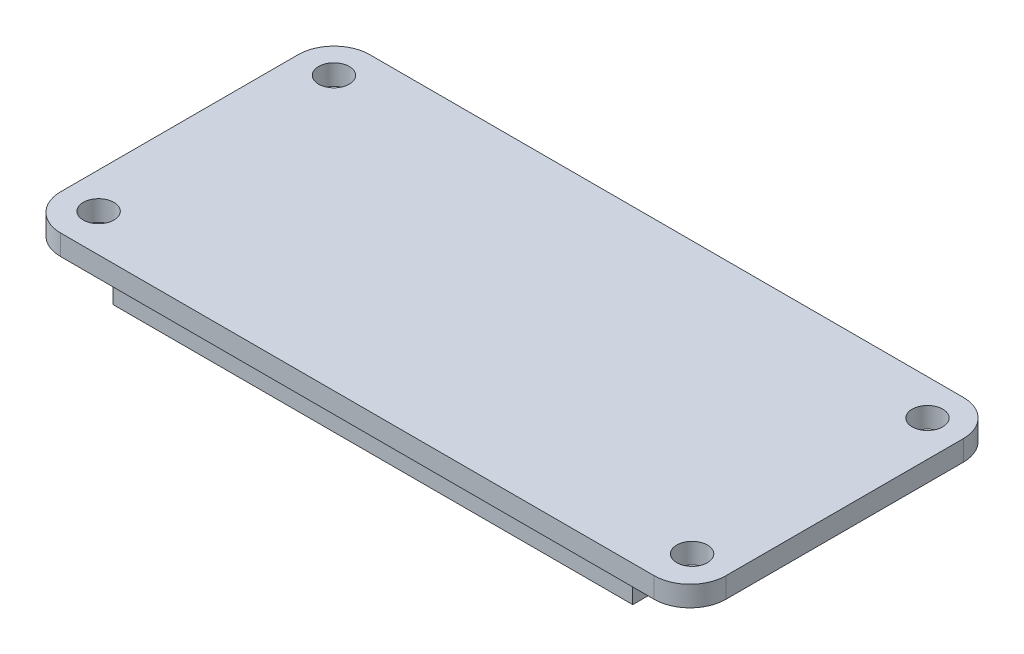
ISO-10303-21;
HEADER;
FILE_DESCRIPTION(('STEP AP214'),'2;1');
FILE_NAME('part.step','',(''),(''),'','','');
FILE_SCHEMA(('AUTOMOTIVE_DESIGN { 1 0 10303 214 1 1 1 1 }'));
ENDSEC;
DATA;
#1=APPLICATION_CONTEXT('core data for automotive mechanical design processes');
#2=APPLICATION_PROTOCOL_DEFINITION('international standard','automotive_design',2000,#1);
#3=PRODUCT_CONTEXT('',#1,'mechanical');
#4=PRODUCT('Part','Part','',(#3));
#5=PRODUCT_RELATED_PRODUCT_CATEGORY('part','',(#4));
#6=PRODUCT_DEFINITION_FORMATION('','',#4);
#7=PRODUCT_DEFINITION_CONTEXT('part definition',#1,'design');
#8=PRODUCT_DEFINITION('design','',#6,#7);
#9=PRODUCT_DEFINITION_SHAPE('','',#8);
#10=(LENGTH_UNIT() NAMED_UNIT(*) SI_UNIT(.MILLI.,.METRE.));
#11=(NAMED_UNIT(*) PLANE_ANGLE_UNIT() SI_UNIT($,.RADIAN.));
#12=(NAMED_UNIT(*) SI_UNIT($,.STERADIAN.) SOLID_ANGLE_UNIT());
#13=UNCERTAINTY_MEASURE_WITH_UNIT(LENGTH_MEASURE(1.E-05),#10,'distance_accuracy_value','');
#14=(GEOMETRIC_REPRESENTATION_CONTEXT(3) GLOBAL_UNCERTAINTY_ASSIGNED_CONTEXT((#13)) GLOBAL_UNIT_ASSIGNED_CONTEXT((#10,
#11,#12)) REPRESENTATION_CONTEXT('',''));
#15=CARTESIAN_POINT('',(0.,0.,0.));
#16=DIRECTION('',(0.,0.,1.));
#17=DIRECTION('',(1.,0.,0.));
#18=AXIS2_PLACEMENT_3D('',#15,#16,#17);
#19=CARTESIAN_POINT('',(0.,0.,0.));
#20=DIRECTION('',(0.,1.,0.));
#21=DIRECTION('',(0.,0.,1.));
#22=AXIS2_PLACEMENT_3D('',#19,#20,#21);
#23=PLANE('',#22);
#24=DIRECTION('',(0.,0.,1.));
#25=VECTOR('',#24,1.);
#26=CARTESIAN_POINT('',(-32.5,0.,-15.1));
#27=LINE('',#26,#25);
#28=CARTESIAN_POINT('',(-32.5,0.,-11.6));
#29=VERTEX_POINT('',#28);
#30=CARTESIAN_POINT('',(-32.5,0.,11.6));
#31=VERTEX_POINT('',#30);
#32=EDGE_CURVE('E192',#29,#31,#27,.T.);
#33=ORIENTED_EDGE('',*,*,#32,.F.);
#34=CARTESIAN_POINT('',(-29.,0.,-11.6));
#35=DIRECTION('',(0.,1.,0.));
#36=DIRECTION('',(0.,0.,1.));
#37=AXIS2_PLACEMENT_3D('',#34,#35,#36);
#38=CIRCLE('',#37,3.5);
#39=CARTESIAN_POINT('',(-29.,0.,-15.1));
#40=VERTEX_POINT('',#39);
#41=EDGE_CURVE('E207',#29,#40,#38,.F.);
#42=ORIENTED_EDGE('',*,*,#41,.T.);
#43=DIRECTION('',(-1.,0.,0.));
#44=VECTOR('',#43,1.);
#45=CARTESIAN_POINT('',(-32.5,0.,-15.1));
#46=LINE('',#45,#44);
#47=CARTESIAN_POINT('',(29.,0.,-15.1));
#48=VERTEX_POINT('',#47);
#49=EDGE_CURVE('E189',#48,#40,#46,.T.);
#50=ORIENTED_EDGE('',*,*,#49,.F.);
#51=CARTESIAN_POINT('',(29.,0.,-11.6));
#52=DIRECTION('',(0.,1.,0.));
#53=DIRECTION('',(0.,0.,1.));
#54=AXIS2_PLACEMENT_3D('',#51,#52,#53);
#55=CIRCLE('',#54,3.5);
#56=CARTESIAN_POINT('',(32.5,0.,-11.6));
#57=VERTEX_POINT('',#56);
#58=EDGE_CURVE('E201',#48,#57,#55,.F.);
#59=ORIENTED_EDGE('',*,*,#58,.T.);
#60=DIRECTION('',(0.,0.,-1.));
#61=VECTOR('',#60,1.);
#62=CARTESIAN_POINT('',(32.5,0.,-15.1));
#63=LINE('',#62,#61);
#64=CARTESIAN_POINT('',(32.5,0.,11.6));
#65=VERTEX_POINT('',#64);
#66=EDGE_CURVE('E170',#65,#57,#63,.T.);
#67=ORIENTED_EDGE('',*,*,#66,.F.);
#68=CARTESIAN_POINT('',(29.,0.,11.6));
#69=DIRECTION('',(0.,1.,0.));
#70=DIRECTION('',(0.,0.,1.));
#71=AXIS2_PLACEMENT_3D('',#68,#69,#70);
#72=CIRCLE('',#71,3.5);
#73=CARTESIAN_POINT('',(29.,0.,15.1));
#74=VERTEX_POINT('',#73);
#75=EDGE_CURVE('E203',#65,#74,#72,.F.);
#76=ORIENTED_EDGE('',*,*,#75,.T.);
#77=DIRECTION('',(1.,0.,0.));
#78=VECTOR('',#77,1.);
#79=CARTESIAN_POINT('',(-32.5,0.,15.1));
#80=LINE('',#79,#78);
#81=CARTESIAN_POINT('',(-29.,0.,15.1));
#82=VERTEX_POINT('',#81);
#83=EDGE_CURVE('E177',#82,#74,#80,.T.);
#84=ORIENTED_EDGE('',*,*,#83,.F.);
#85=CARTESIAN_POINT('',(-29.,0.,11.6));
#86=DIRECTION('',(0.,1.,0.));
#87=DIRECTION('',(0.,0.,1.));
#88=AXIS2_PLACEMENT_3D('',#85,#86,#87);
#89=CIRCLE('',#88,3.5);
#90=EDGE_CURVE('E205',#82,#31,#89,.F.);
#91=ORIENTED_EDGE('',*,*,#90,.T.);
#92=EDGE_LOOP('',(#33,#42,#50,#59,#67,#76,#84,#91));
#93=FACE_BOUND('',#92,.T.);
#94=CARTESIAN_POINT('',(-29.,0.,-11.6));
#95=DIRECTION('',(0.,1.,0.));
#96=DIRECTION('',(0.,0.,1.));
#97=AXIS2_PLACEMENT_3D('',#94,#95,#96);
#98=CIRCLE('',#97,1.5);
#99=CARTESIAN_POINT('',(-29.,0.,-10.1));
#100=VERTEX_POINT('',#99);
#101=EDGE_CURVE('E167',#100,#100,#98,.T.);
#102=ORIENTED_EDGE('',*,*,#101,.T.);
#103=EDGE_LOOP('',(#102));
#104=FACE_BOUND('',#103,.T.);
#105=CARTESIAN_POINT('',(-29.,0.,11.4));
#106=DIRECTION('',(0.,1.,0.));
#107=DIRECTION('',(0.,0.,1.));
#108=AXIS2_PLACEMENT_3D('',#105,#106,#107);
#109=CIRCLE('',#108,1.5);
#110=CARTESIAN_POINT('',(-29.,0.,12.9));
#111=VERTEX_POINT('',#110);
#112=EDGE_CURVE('E152',#111,#111,#109,.T.);
#113=ORIENTED_EDGE('',*,*,#112,.T.);
#114=EDGE_LOOP('',(#113));
#115=FACE_BOUND('',#114,.T.);
#116=CARTESIAN_POINT('',(29.,0.,11.4));
#117=DIRECTION('',(0.,1.,0.));
#118=DIRECTION('',(0.,0.,-1.));
#119=AXIS2_PLACEMENT_3D('',#116,#117,#118);
#120=CIRCLE('',#119,1.5);
#121=CARTESIAN_POINT('',(29.,0.,9.89999999999998));
#122=VERTEX_POINT('',#121);
#123=EDGE_CURVE('E159',#122,#122,#120,.T.);
#124=ORIENTED_EDGE('',*,*,#123,.T.);
#125=EDGE_LOOP('',(#124));
#126=FACE_BOUND('',#125,.T.);
#127=CARTESIAN_POINT('',(29.,0.,-11.6));
#128=DIRECTION('',(0.,1.,0.));
#129=DIRECTION('',(0.,0.,-1.));
#130=AXIS2_PLACEMENT_3D('',#127,#128,#129);
#131=CIRCLE('',#130,1.5);
#132=CARTESIAN_POINT('',(29.,0.,-13.1));
#133=VERTEX_POINT('',#132);
#134=EDGE_CURVE('E146',#133,#133,#131,.T.);
#135=ORIENTED_EDGE('',*,*,#134,.T.);
#136=EDGE_LOOP('',(#135));
#137=FACE_BOUND('',#136,.T.);
#138=DIRECTION('',(0.,0.,1.));
#139=VECTOR('',#138,1.);
#140=CARTESIAN_POINT('',(25.4,0.,13.6));
#141=LINE('',#140,#139);
#142=CARTESIAN_POINT('',(25.4,0.,8.52));
#143=VERTEX_POINT('',#142);
#144=CARTESIAN_POINT('',(25.4,0.,13.6));
#145=VERTEX_POINT('',#144);
#146=EDGE_CURVE('E142',#143,#145,#141,.T.);
#147=ORIENTED_EDGE('',*,*,#146,.F.);
#148=DIRECTION('',(1.,0.,0.));
#149=VECTOR('',#148,1.);
#150=CARTESIAN_POINT('',(-25.4,0.,8.52));
#151=LINE('',#150,#149);
#152=CARTESIAN_POINT('',(-25.4,0.,8.52));
#153=VERTEX_POINT('',#152);
#154=EDGE_CURVE('E139',#153,#143,#151,.T.);
#155=ORIENTED_EDGE('',*,*,#154,.F.);
#156=DIRECTION('',(0.,0.,-1.));
#157=VECTOR('',#156,1.);
#158=CARTESIAN_POINT('',(-25.4,0.,13.6));
#159=LINE('',#158,#157);
#160=CARTESIAN_POINT('',(-25.4,0.,13.6));
#161=VERTEX_POINT('',#160);
#162=EDGE_CURVE('E53',#161,#153,#159,.T.);
#163=ORIENTED_EDGE('',*,*,#162,.F.);
#164=DIRECTION('',(-1.,0.,0.));
#165=VECTOR('',#164,1.);
#166=CARTESIAN_POINT('',(-25.4,0.,13.6));
#167=LINE('',#166,#165);
#168=EDGE_CURVE('E48',#145,#161,#167,.T.);
#169=ORIENTED_EDGE('',*,*,#168,.F.);
#170=EDGE_LOOP('',(#147,#155,#163,#169));
#171=FACE_BOUND('',#170,.T.);
#172=ADVANCED_FACE('F33',(#93,#104,#115,#126,#137,#171),#23,.F.);
#173=CARTESIAN_POINT('',(32.5,2.,-15.1));
#174=DIRECTION('',(-1.,0.,0.));
#175=DIRECTION('',(0.,0.,1.));
#176=AXIS2_PLACEMENT_3D('',#173,#174,#175);
#177=PLANE('',#176);
#178=DIRECTION('',(0.,0.,-1.));
#179=VECTOR('',#178,1.);
#180=CARTESIAN_POINT('',(32.5,2.,-15.1));
#181=LINE('',#180,#179);
#182=CARTESIAN_POINT('',(32.5,2.,11.6));
#183=VERTEX_POINT('',#182);
#184=CARTESIAN_POINT('',(32.5,2.,-11.6));
#185=VERTEX_POINT('',#184);
#186=EDGE_CURVE('E173',#183,#185,#181,.T.);
#187=ORIENTED_EDGE('',*,*,#186,.F.);
#188=DIRECTION('',(0.,-1.,0.));
#189=VECTOR('',#188,1.);
#190=CARTESIAN_POINT('',(32.5,2.,11.6));
#191=LINE('',#190,#189);
#192=EDGE_CURVE('E11',#183,#65,#191,.T.);
#193=ORIENTED_EDGE('',*,*,#192,.T.);
#194=ORIENTED_EDGE('',*,*,#66,.T.);
#195=DIRECTION('',(0.,-1.,0.));
#196=VECTOR('',#195,1.);
#197=CARTESIAN_POINT('',(32.5,2.,-11.6));
#198=LINE('',#197,#196);
#199=EDGE_CURVE('E41',#57,#185,#198,.F.);
#200=ORIENTED_EDGE('',*,*,#199,.T.);
#201=EDGE_LOOP('',(#187,#193,#194,#200));
#202=FACE_BOUND('',#201,.T.);
#203=ADVANCED_FACE('F229',(#202),#177,.F.);
#204=CARTESIAN_POINT('',(-32.5,2.,-15.1));
#205=DIRECTION('',(0.,0.,1.));
#206=DIRECTION('',(1.,0.,0.));
#207=AXIS2_PLACEMENT_3D('',#204,#205,#206);
#208=PLANE('',#207);
#209=ORIENTED_EDGE('',*,*,#49,.T.);
#210=DIRECTION('',(0.,-1.,0.));
#211=VECTOR('',#210,1.);
#212=CARTESIAN_POINT('',(-29.,2.,-15.1));
#213=LINE('',#212,#211);
#214=CARTESIAN_POINT('',(-29.,2.,-15.1));
#215=VERTEX_POINT('',#214);
#216=EDGE_CURVE('E212',#40,#215,#213,.F.);
#217=ORIENTED_EDGE('',*,*,#216,.T.);
#218=DIRECTION('',(-1.,0.,0.));
#219=VECTOR('',#218,1.);
#220=CARTESIAN_POINT('',(-32.5,2.,-15.1));
#221=LINE('',#220,#219);
#222=CARTESIAN_POINT('',(29.,2.,-15.1));
#223=VERTEX_POINT('',#222);
#224=EDGE_CURVE('E176',#223,#215,#221,.T.);
#225=ORIENTED_EDGE('',*,*,#224,.F.);
#226=DIRECTION('',(0.,-1.,0.));
#227=VECTOR('',#226,1.);
#228=CARTESIAN_POINT('',(29.,2.,-15.1));
#229=LINE('',#228,#227);
#230=EDGE_CURVE('E209',#223,#48,#229,.T.);
#231=ORIENTED_EDGE('',*,*,#230,.T.);
#232=EDGE_LOOP('',(#209,#217,#225,#231));
#233=FACE_BOUND('',#232,.T.);
#234=ADVANCED_FACE('F241',(#233),#208,.F.);
#235=CARTESIAN_POINT('',(-32.5,2.,-15.1));
#236=DIRECTION('',(1.,0.,0.));
#237=DIRECTION('',(0.,0.,-1.));
#238=AXIS2_PLACEMENT_3D('',#235,#236,#237);
#239=PLANE('',#238);
#240=DIRECTION('',(0.,0.,1.));
#241=VECTOR('',#240,1.);
#242=CARTESIAN_POINT('',(-32.5,2.,-15.1));
#243=LINE('',#242,#241);
#244=CARTESIAN_POINT('',(-32.5,2.,-11.6));
#245=VERTEX_POINT('',#244);
#246=CARTESIAN_POINT('',(-32.5,2.,11.6));
#247=VERTEX_POINT('',#246);
#248=EDGE_CURVE('E180',#245,#247,#243,.T.);
#249=ORIENTED_EDGE('',*,*,#248,.F.);
#250=DIRECTION('',(0.,-1.,0.));
#251=VECTOR('',#250,1.);
#252=CARTESIAN_POINT('',(-32.5,2.,-11.6));
#253=LINE('',#252,#251);
#254=EDGE_CURVE('E198',#245,#29,#253,.T.);
#255=ORIENTED_EDGE('',*,*,#254,.T.);
#256=ORIENTED_EDGE('',*,*,#32,.T.);
#257=DIRECTION('',(0.,-1.,0.));
#258=VECTOR('',#257,1.);
#259=CARTESIAN_POINT('',(-32.5,2.,11.6));
#260=LINE('',#259,#258);
#261=EDGE_CURVE('E186',#31,#247,#260,.F.);
#262=ORIENTED_EDGE('',*,*,#261,.T.);
#263=EDGE_LOOP('',(#249,#255,#256,#262));
#264=FACE_BOUND('',#263,.T.);
#265=ADVANCED_FACE('F252',(#264),#239,.F.);
#266=CARTESIAN_POINT('',(-32.5,2.,15.1));
#267=DIRECTION('',(0.,0.,-1.));
#268=DIRECTION('',(-1.,0.,0.));
#269=AXIS2_PLACEMENT_3D('',#266,#267,#268);
#270=PLANE('',#269);
#271=DIRECTION('',(1.,0.,0.));
#272=VECTOR('',#271,1.);
#273=CARTESIAN_POINT('',(-32.5,2.,15.1));
#274=LINE('',#273,#272);
#275=CARTESIAN_POINT('',(-29.,2.,15.1));
#276=VERTEX_POINT('',#275);
#277=CARTESIAN_POINT('',(29.,2.,15.1));
#278=VERTEX_POINT('',#277);
#279=EDGE_CURVE('E183',#276,#278,#274,.T.);
#280=ORIENTED_EDGE('',*,*,#279,.F.);
#281=DIRECTION('',(0.,-1.,0.));
#282=VECTOR('',#281,1.);
#283=CARTESIAN_POINT('',(-29.,2.,15.1));
#284=LINE('',#283,#282);
#285=EDGE_CURVE('E224',#276,#82,#284,.T.);
#286=ORIENTED_EDGE('',*,*,#285,.T.);
#287=ORIENTED_EDGE('',*,*,#83,.T.);
#288=DIRECTION('',(0.,-1.,0.));
#289=VECTOR('',#288,1.);
#290=CARTESIAN_POINT('',(29.,2.,15.1));
#291=LINE('',#290,#289);
#292=EDGE_CURVE('E222',#74,#278,#291,.F.);
#293=ORIENTED_EDGE('',*,*,#292,.T.);
#294=EDGE_LOOP('',(#280,#286,#287,#293));
#295=FACE_BOUND('',#294,.T.);
#296=ADVANCED_FACE('F261',(#295),#270,.F.);
#297=CARTESIAN_POINT('',(0.,2.,0.));
#298=DIRECTION('',(0.,1.,0.));
#299=DIRECTION('',(0.,0.,1.));
#300=AXIS2_PLACEMENT_3D('',#297,#298,#299);
#301=PLANE('',#300);
#302=CARTESIAN_POINT('',(29.,2.,-11.6));
#303=DIRECTION('',(0.,1.,0.));
#304=DIRECTION('',(0.,0.,-1.));
#305=AXIS2_PLACEMENT_3D('',#302,#303,#304);
#306=CIRCLE('',#305,1.5);
#307=CARTESIAN_POINT('',(29.,2.,-13.1));
#308=VERTEX_POINT('',#307);
#309=EDGE_CURVE('E143',#308,#308,#306,.T.);
#310=ORIENTED_EDGE('',*,*,#309,.F.);
#311=EDGE_LOOP('',(#310));
#312=FACE_BOUND('',#311,.T.);
#313=CARTESIAN_POINT('',(29.,2.,11.4));
#314=DIRECTION('',(0.,1.,0.));
#315=DIRECTION('',(0.,0.,-1.));
#316=AXIS2_PLACEMENT_3D('',#313,#314,#315);
#317=CIRCLE('',#316,1.5);
#318=CARTESIAN_POINT('',(29.,2.,9.89999999999998));
#319=VERTEX_POINT('',#318);
#320=EDGE_CURVE('E162',#319,#319,#317,.T.);
#321=ORIENTED_EDGE('',*,*,#320,.F.);
#322=EDGE_LOOP('',(#321));
#323=FACE_BOUND('',#322,.T.);
#324=CARTESIAN_POINT('',(-29.,2.,11.4));
#325=DIRECTION('',(0.,1.,0.));
#326=DIRECTION('',(0.,0.,1.));
#327=AXIS2_PLACEMENT_3D('',#324,#325,#326);
#328=CIRCLE('',#327,1.5);
#329=CARTESIAN_POINT('',(-29.,2.,12.9));
#330=VERTEX_POINT('',#329);
#331=EDGE_CURVE('E156',#330,#330,#328,.T.);
#332=ORIENTED_EDGE('',*,*,#331,.F.);
#333=EDGE_LOOP('',(#332));
#334=FACE_BOUND('',#333,.T.);
#335=CARTESIAN_POINT('',(-29.,2.,-11.6));
#336=DIRECTION('',(0.,1.,0.));
#337=DIRECTION('',(0.,0.,1.));
#338=AXIS2_PLACEMENT_3D('',#335,#336,#337);
#339=CIRCLE('',#338,1.5);
#340=CARTESIAN_POINT('',(-29.,2.,-10.1));
#341=VERTEX_POINT('',#340);
#342=EDGE_CURVE('E155',#341,#341,#339,.T.);
#343=ORIENTED_EDGE('',*,*,#342,.F.);
#344=EDGE_LOOP('',(#343));
#345=FACE_BOUND('',#344,.T.);
#346=ORIENTED_EDGE('',*,*,#224,.T.);
#347=CARTESIAN_POINT('',(-29.,2.,-11.6));
#348=DIRECTION('',(0.,1.,0.));
#349=DIRECTION('',(0.,0.,1.));
#350=AXIS2_PLACEMENT_3D('',#347,#348,#349);
#351=CIRCLE('',#350,3.5);
#352=EDGE_CURVE('E220',#215,#245,#351,.T.);
#353=ORIENTED_EDGE('',*,*,#352,.T.);
#354=ORIENTED_EDGE('',*,*,#248,.T.);
#355=CARTESIAN_POINT('',(-29.,2.,11.6));
#356=DIRECTION('',(0.,1.,0.));
#357=DIRECTION('',(0.,0.,1.));
#358=AXIS2_PLACEMENT_3D('',#355,#356,#357);
#359=CIRCLE('',#358,3.5);
#360=EDGE_CURVE('E218',#247,#276,#359,.T.);
#361=ORIENTED_EDGE('',*,*,#360,.T.);
#362=ORIENTED_EDGE('',*,*,#279,.T.);
#363=CARTESIAN_POINT('',(29.,2.,11.6));
#364=DIRECTION('',(0.,1.,0.));
#365=DIRECTION('',(0.,0.,1.));
#366=AXIS2_PLACEMENT_3D('',#363,#364,#365);
#367=CIRCLE('',#366,3.5);
#368=EDGE_CURVE('E216',#278,#183,#367,.T.);
#369=ORIENTED_EDGE('',*,*,#368,.T.);
#370=ORIENTED_EDGE('',*,*,#186,.T.);
#371=CARTESIAN_POINT('',(29.,2.,-11.6));
#372=DIRECTION('',(0.,1.,0.));
#373=DIRECTION('',(0.,0.,1.));
#374=AXIS2_PLACEMENT_3D('',#371,#372,#373);
#375=CIRCLE('',#374,3.5);
#376=EDGE_CURVE('E214',#185,#223,#375,.T.);
#377=ORIENTED_EDGE('',*,*,#376,.T.);
#378=EDGE_LOOP('',(#346,#353,#354,#361,#362,#369,#370,#377));
#379=FACE_BOUND('',#378,.T.);
#380=ADVANCED_FACE('F235',(#312,#323,#334,#345,#379),#301,.T.);
#381=CARTESIAN_POINT('',(-29.,0.,-11.6));
#382=DIRECTION('',(0.,1.,0.));
#383=DIRECTION('',(0.,0.,1.));
#384=AXIS2_PLACEMENT_3D('',#381,#382,#383);
#385=CYLINDRICAL_SURFACE('',#384,1.5);
#386=ORIENTED_EDGE('',*,*,#101,.F.);
#387=EDGE_LOOP('',(#386));
#388=FACE_BOUND('',#387,.T.);
#389=ORIENTED_EDGE('',*,*,#342,.T.);
#390=EDGE_LOOP('',(#389));
#391=FACE_BOUND('',#390,.T.);
#392=ADVANCED_FACE('F305',(#388,#391),#385,.F.);
#393=CARTESIAN_POINT('',(-29.,0.,11.4));
#394=DIRECTION('',(0.,1.,0.));
#395=DIRECTION('',(0.,0.,1.));
#396=AXIS2_PLACEMENT_3D('',#393,#394,#395);
#397=CYLINDRICAL_SURFACE('',#396,1.5);
#398=ORIENTED_EDGE('',*,*,#112,.F.);
#399=EDGE_LOOP('',(#398));
#400=FACE_BOUND('',#399,.T.);
#401=ORIENTED_EDGE('',*,*,#331,.T.);
#402=EDGE_LOOP('',(#401));
#403=FACE_BOUND('',#402,.T.);
#404=ADVANCED_FACE('F299',(#400,#403),#397,.F.);
#405=CARTESIAN_POINT('',(29.,0.,11.4));
#406=DIRECTION('',(0.,1.,0.));
#407=DIRECTION('',(0.,0.,1.));
#408=AXIS2_PLACEMENT_3D('',#405,#406,#407);
#409=CYLINDRICAL_SURFACE('',#408,1.5);
#410=ORIENTED_EDGE('',*,*,#123,.F.);
#411=EDGE_LOOP('',(#410));
#412=FACE_BOUND('',#411,.T.);
#413=ORIENTED_EDGE('',*,*,#320,.T.);
#414=EDGE_LOOP('',(#413));
#415=FACE_BOUND('',#414,.T.);
#416=ADVANCED_FACE('F293',(#412,#415),#409,.F.);
#417=CARTESIAN_POINT('',(29.,0.,-11.6));
#418=DIRECTION('',(0.,1.,0.));
#419=DIRECTION('',(0.,0.,1.));
#420=AXIS2_PLACEMENT_3D('',#417,#418,#419);
#421=CYLINDRICAL_SURFACE('',#420,1.5);
#422=ORIENTED_EDGE('',*,*,#134,.F.);
#423=EDGE_LOOP('',(#422));
#424=FACE_BOUND('',#423,.T.);
#425=ORIENTED_EDGE('',*,*,#309,.T.);
#426=EDGE_LOOP('',(#425));
#427=FACE_BOUND('',#426,.T.);
#428=ADVANCED_FACE('F289',(#424,#427),#421,.F.);
#429=CARTESIAN_POINT('',(-29.,2.,-11.6));
#430=DIRECTION('',(0.,-1.,0.));
#431=DIRECTION('',(0.,0.,-1.));
#432=AXIS2_PLACEMENT_3D('',#429,#430,#431);
#433=CYLINDRICAL_SURFACE('',#432,3.5);
#434=ORIENTED_EDGE('',*,*,#352,.F.);
#435=ORIENTED_EDGE('',*,*,#216,.F.);
#436=ORIENTED_EDGE('',*,*,#41,.F.);
#437=ORIENTED_EDGE('',*,*,#254,.F.);
#438=EDGE_LOOP('',(#434,#435,#436,#437));
#439=FACE_BOUND('',#438,.T.);
#440=ADVANCED_FACE('F249',(#439),#433,.T.);
#441=CARTESIAN_POINT('',(-29.,2.,11.6));
#442=DIRECTION('',(0.,-1.,0.));
#443=DIRECTION('',(0.,0.,-1.));
#444=AXIS2_PLACEMENT_3D('',#441,#442,#443);
#445=CYLINDRICAL_SURFACE('',#444,3.5);
#446=ORIENTED_EDGE('',*,*,#360,.F.);
#447=ORIENTED_EDGE('',*,*,#261,.F.);
#448=ORIENTED_EDGE('',*,*,#90,.F.);
#449=ORIENTED_EDGE('',*,*,#285,.F.);
#450=EDGE_LOOP('',(#446,#447,#448,#449));
#451=FACE_BOUND('',#450,.T.);
#452=ADVANCED_FACE('F258',(#451),#445,.T.);
#453=CARTESIAN_POINT('',(29.,2.,11.6));
#454=DIRECTION('',(0.,-1.,0.));
#455=DIRECTION('',(0.,0.,-1.));
#456=AXIS2_PLACEMENT_3D('',#453,#454,#455);
#457=CYLINDRICAL_SURFACE('',#456,3.5);
#458=ORIENTED_EDGE('',*,*,#368,.F.);
#459=ORIENTED_EDGE('',*,*,#292,.F.);
#460=ORIENTED_EDGE('',*,*,#75,.F.);
#461=ORIENTED_EDGE('',*,*,#192,.F.);
#462=EDGE_LOOP('',(#458,#459,#460,#461));
#463=FACE_BOUND('',#462,.T.);
#464=ADVANCED_FACE('F264',(#463),#457,.T.);
#465=CARTESIAN_POINT('',(29.,2.,-11.6));
#466=DIRECTION('',(0.,-1.,0.));
#467=DIRECTION('',(0.,0.,-1.));
#468=AXIS2_PLACEMENT_3D('',#465,#466,#467);
#469=CYLINDRICAL_SURFACE('',#468,3.5);
#470=ORIENTED_EDGE('',*,*,#376,.F.);
#471=ORIENTED_EDGE('',*,*,#199,.F.);
#472=ORIENTED_EDGE('',*,*,#58,.F.);
#473=ORIENTED_EDGE('',*,*,#230,.F.);
#474=EDGE_LOOP('',(#470,#471,#472,#473));
#475=FACE_BOUND('',#474,.T.);
#476=ADVANCED_FACE('F35',(#475),#469,.T.);
#477=CARTESIAN_POINT('',(25.4,-3.,13.6));
#478=DIRECTION('',(-1.,0.,0.));
#479=DIRECTION('',(0.,0.,1.));
#480=AXIS2_PLACEMENT_3D('',#477,#478,#479);
#481=PLANE('',#480);
#482=ORIENTED_EDGE('',*,*,#146,.T.);
#483=DIRECTION('',(0.,1.,0.));
#484=VECTOR('',#483,1.);
#485=CARTESIAN_POINT('',(25.4,-3.,13.6));
#486=LINE('',#485,#484);
#487=CARTESIAN_POINT('',(25.4,-3.,13.6));
#488=VERTEX_POINT('',#487);
#489=EDGE_CURVE('E123',#488,#145,#486,.T.);
#490=ORIENTED_EDGE('',*,*,#489,.F.);
#491=DIRECTION('',(0.,0.,1.));
#492=VECTOR('',#491,1.);
#493=CARTESIAN_POINT('',(25.4,-3.,13.6));
#494=LINE('',#493,#492);
#495=CARTESIAN_POINT('',(25.4,-3.,8.52));
#496=VERTEX_POINT('',#495);
#497=EDGE_CURVE('E130',#496,#488,#494,.T.);
#498=ORIENTED_EDGE('',*,*,#497,.F.);
#499=DIRECTION('',(0.,1.,0.));
#500=VECTOR('',#499,1.);
#501=CARTESIAN_POINT('',(25.4,-3.,8.52));
#502=LINE('',#501,#500);
#503=EDGE_CURVE('E329',#496,#143,#502,.T.);
#504=ORIENTED_EDGE('',*,*,#503,.T.);
#505=EDGE_LOOP('',(#482,#490,#498,#504));
#506=FACE_BOUND('',#505,.T.);
#507=ADVANCED_FACE('F141',(#506),#481,.F.);
#508=CARTESIAN_POINT('',(-25.4,-3.,13.6));
#509=DIRECTION('',(0.,0.,-1.));
#510=DIRECTION('',(-1.,0.,0.));
#511=AXIS2_PLACEMENT_3D('',#508,#509,#510);
#512=PLANE('',#511);
#513=ORIENTED_EDGE('',*,*,#168,.T.);
#514=DIRECTION('',(0.,1.,0.));
#515=VECTOR('',#514,1.);
#516=CARTESIAN_POINT('',(-25.4,-3.,13.6));
#517=LINE('',#516,#515);
#518=CARTESIAN_POINT('',(-25.4,-3.,13.6));
#519=VERTEX_POINT('',#518);
#520=EDGE_CURVE('E126',#519,#161,#517,.T.);
#521=ORIENTED_EDGE('',*,*,#520,.F.);
#522=DIRECTION('',(-1.,0.,0.));
#523=VECTOR('',#522,1.);
#524=CARTESIAN_POINT('',(-25.4,-3.,13.6));
#525=LINE('',#524,#523);
#526=EDGE_CURVE('E119',#488,#519,#525,.T.);
#527=ORIENTED_EDGE('',*,*,#526,.F.);
#528=ORIENTED_EDGE('',*,*,#489,.T.);
#529=EDGE_LOOP('',(#513,#521,#527,#528));
#530=FACE_BOUND('',#529,.T.);
#531=ADVANCED_FACE('F121',(#530),#512,.F.);
#532=CARTESIAN_POINT('',(-25.4,-3.,13.6));
#533=DIRECTION('',(1.,0.,0.));
#534=DIRECTION('',(0.,0.,-1.));
#535=AXIS2_PLACEMENT_3D('',#532,#533,#534);
#536=PLANE('',#535);
#537=ORIENTED_EDGE('',*,*,#162,.T.);
#538=DIRECTION('',(0.,1.,0.));
#539=VECTOR('',#538,1.);
#540=CARTESIAN_POINT('',(-25.4,-3.,8.52));
#541=LINE('',#540,#539);
#542=CARTESIAN_POINT('',(-25.4,-3.,8.52));
#543=VERTEX_POINT('',#542);
#544=EDGE_CURVE('E148',#543,#153,#541,.T.);
#545=ORIENTED_EDGE('',*,*,#544,.F.);
#546=DIRECTION('',(0.,0.,-1.));
#547=VECTOR('',#546,1.);
#548=CARTESIAN_POINT('',(-25.4,-3.,13.6));
#549=LINE('',#548,#547);
#550=EDGE_CURVE('E129',#519,#543,#549,.T.);
#551=ORIENTED_EDGE('',*,*,#550,.F.);
#552=ORIENTED_EDGE('',*,*,#520,.T.);
#553=EDGE_LOOP('',(#537,#545,#551,#552));
#554=FACE_BOUND('',#553,.T.);
#555=ADVANCED_FACE('F338',(#554),#536,.F.);
#556=CARTESIAN_POINT('',(-25.4,-3.,8.52));
#557=DIRECTION('',(0.,0.,1.));
#558=DIRECTION('',(1.,0.,0.));
#559=AXIS2_PLACEMENT_3D('',#556,#557,#558);
#560=PLANE('',#559);
#561=ORIENTED_EDGE('',*,*,#154,.T.);
#562=ORIENTED_EDGE('',*,*,#503,.F.);
#563=DIRECTION('',(1.,0.,0.));
#564=VECTOR('',#563,1.);
#565=CARTESIAN_POINT('',(-25.4,-3.,8.52));
#566=LINE('',#565,#564);
#567=EDGE_CURVE('E135',#543,#496,#566,.T.);
#568=ORIENTED_EDGE('',*,*,#567,.F.);
#569=ORIENTED_EDGE('',*,*,#544,.T.);
#570=EDGE_LOOP('',(#561,#562,#568,#569));
#571=FACE_BOUND('',#570,.T.);
#572=ADVANCED_FACE('F328',(#571),#560,.F.);
#573=CARTESIAN_POINT('',(0.,-3.,0.));
#574=DIRECTION('',(0.,-1.,0.));
#575=DIRECTION('',(0.,0.,-1.));
#576=AXIS2_PLACEMENT_3D('',#573,#574,#575);
#577=PLANE('',#576);
#578=ORIENTED_EDGE('',*,*,#497,.T.);
#579=ORIENTED_EDGE('',*,*,#526,.T.);
#580=ORIENTED_EDGE('',*,*,#550,.T.);
#581=ORIENTED_EDGE('',*,*,#567,.T.);
#582=EDGE_LOOP('',(#578,#579,#580,#581));
#583=FACE_BOUND('',#582,.T.);
#584=ADVANCED_FACE('F133',(#583),#577,.T.);
#585=CLOSED_SHELL('',(#172,#203,#234,#265,#296,#380,#392,#404,#416,#428,#440,#452,#464,#476,
#507,#531,#555,#572,#584));
#586=MANIFOLD_SOLID_BREP('B2',#585);
#587=ADVANCED_BREP_SHAPE_REPRESENTATION('',(#18,#586),#14);
#588=SHAPE_DEFINITION_REPRESENTATION(#9,#587);
ENDSEC;
END-ISO-10303-21;
